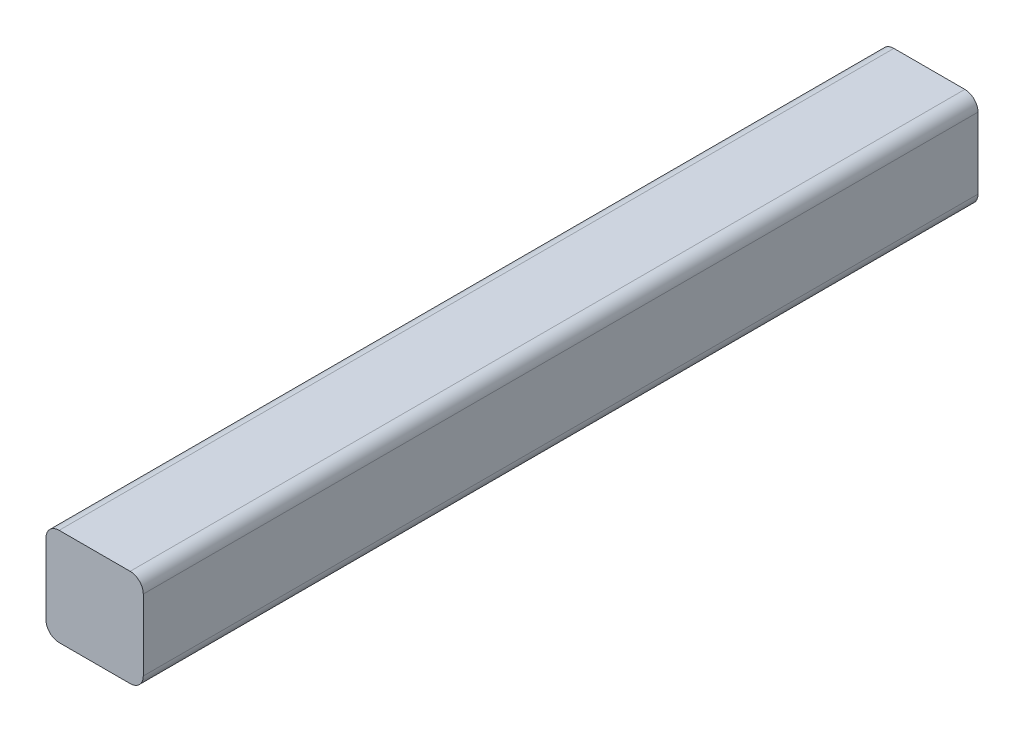
ISO-10303-21;
HEADER;
FILE_DESCRIPTION(('STEP AP214'),'2;1');
FILE_NAME('part.step','',(''),(''),'','','');
FILE_SCHEMA(('AUTOMOTIVE_DESIGN { 1 0 10303 214 1 1 1 1 }'));
ENDSEC;
DATA;
#1=APPLICATION_CONTEXT('core data for automotive mechanical design processes');
#2=APPLICATION_PROTOCOL_DEFINITION('international standard','automotive_design',2000,#1);
#3=PRODUCT_CONTEXT('',#1,'mechanical');
#4=PRODUCT('Part','Part','',(#3));
#5=PRODUCT_RELATED_PRODUCT_CATEGORY('part','',(#4));
#6=PRODUCT_DEFINITION_FORMATION('','',#4);
#7=PRODUCT_DEFINITION_CONTEXT('part definition',#1,'design');
#8=PRODUCT_DEFINITION('design','',#6,#7);
#9=PRODUCT_DEFINITION_SHAPE('','',#8);
#10=(LENGTH_UNIT() NAMED_UNIT(*) SI_UNIT(.MILLI.,.METRE.));
#11=(NAMED_UNIT(*) PLANE_ANGLE_UNIT() SI_UNIT($,.RADIAN.));
#12=(NAMED_UNIT(*) SI_UNIT($,.STERADIAN.) SOLID_ANGLE_UNIT());
#13=UNCERTAINTY_MEASURE_WITH_UNIT(LENGTH_MEASURE(1.E-05),#10,'distance_accuracy_value','');
#14=(GEOMETRIC_REPRESENTATION_CONTEXT(3) GLOBAL_UNCERTAINTY_ASSIGNED_CONTEXT((#13)) GLOBAL_UNIT_ASSIGNED_CONTEXT((#10,
#11,#12)) REPRESENTATION_CONTEXT('',''));
#15=CARTESIAN_POINT('',(0.,0.,0.));
#16=DIRECTION('',(0.,0.,1.));
#17=DIRECTION('',(1.,0.,0.));
#18=AXIS2_PLACEMENT_3D('',#15,#16,#17);
#19=CARTESIAN_POINT('',(-7.4,-7.4,127.));
#20=DIRECTION('',(1.,0.,0.));
#21=DIRECTION('',(0.,0.,-1.));
#22=AXIS2_PLACEMENT_3D('',#19,#20,#21);
#23=PLANE('',#22);
#24=DIRECTION('',(0.,-1.,0.));
#25=VECTOR('',#24,1.);
#26=CARTESIAN_POINT('',(-7.4,-7.4,0.));
#27=LINE('',#26,#25);
#28=CARTESIAN_POINT('',(-7.4,5.4,0.));
#29=VERTEX_POINT('',#28);
#30=CARTESIAN_POINT('',(-7.4,-5.4,0.));
#31=VERTEX_POINT('',#30);
#32=EDGE_CURVE('E125',#29,#31,#27,.T.);
#33=ORIENTED_EDGE('',*,*,#32,.T.);
#34=DIRECTION('',(0.,0.,-1.));
#35=VECTOR('',#34,1.);
#36=CARTESIAN_POINT('',(-7.4,-5.4,127.));
#37=LINE('',#36,#35);
#38=CARTESIAN_POINT('',(-7.4,-5.4,127.));
#39=VERTEX_POINT('',#38);
#40=EDGE_CURVE('E103',#31,#39,#37,.F.);
#41=ORIENTED_EDGE('',*,*,#40,.T.);
#42=DIRECTION('',(0.,-1.,0.));
#43=VECTOR('',#42,1.);
#44=CARTESIAN_POINT('',(-7.4,-7.4,127.));
#45=LINE('',#44,#43);
#46=CARTESIAN_POINT('',(-7.4,5.4,127.));
#47=VERTEX_POINT('',#46);
#48=EDGE_CURVE('E134',#47,#39,#45,.T.);
#49=ORIENTED_EDGE('',*,*,#48,.F.);
#50=DIRECTION('',(0.,0.,-1.));
#51=VECTOR('',#50,1.);
#52=CARTESIAN_POINT('',(-7.4,5.4,127.));
#53=LINE('',#52,#51);
#54=EDGE_CURVE('E108',#47,#29,#53,.T.);
#55=ORIENTED_EDGE('',*,*,#54,.T.);
#56=EDGE_LOOP('',(#33,#41,#49,#55));
#57=FACE_BOUND('',#56,.T.);
#58=ADVANCED_FACE('F33',(#57),#23,.F.);
#59=CARTESIAN_POINT('',(7.4,-7.4,127.));
#60=DIRECTION('',(0.,1.,0.));
#61=DIRECTION('',(-1.,0.,0.));
#62=AXIS2_PLACEMENT_3D('',#59,#60,#61);
#63=PLANE('',#62);
#64=DIRECTION('',(1.,0.,0.));
#65=VECTOR('',#64,1.);
#66=CARTESIAN_POINT('',(7.4,-7.4,127.));
#67=LINE('',#66,#65);
#68=CARTESIAN_POINT('',(-5.4,-7.4,127.));
#69=VERTEX_POINT('',#68);
#70=CARTESIAN_POINT('',(5.4,-7.4,127.));
#71=VERTEX_POINT('',#70);
#72=EDGE_CURVE('E118',#69,#71,#67,.T.);
#73=ORIENTED_EDGE('',*,*,#72,.F.);
#74=DIRECTION('',(0.,0.,-1.));
#75=VECTOR('',#74,1.);
#76=CARTESIAN_POINT('',(-5.4,-7.4,127.));
#77=LINE('',#76,#75);
#78=CARTESIAN_POINT('',(-5.4,-7.4,0.));
#79=VERTEX_POINT('',#78);
#80=EDGE_CURVE('E102',#69,#79,#77,.T.);
#81=ORIENTED_EDGE('',*,*,#80,.T.);
#82=DIRECTION('',(1.,0.,0.));
#83=VECTOR('',#82,1.);
#84=CARTESIAN_POINT('',(7.4,-7.4,0.));
#85=LINE('',#84,#83);
#86=CARTESIAN_POINT('',(5.4,-7.4,0.));
#87=VERTEX_POINT('',#86);
#88=EDGE_CURVE('E115',#79,#87,#85,.T.);
#89=ORIENTED_EDGE('',*,*,#88,.T.);
#90=DIRECTION('',(0.,0.,-1.));
#91=VECTOR('',#90,1.);
#92=CARTESIAN_POINT('',(5.4,-7.4,127.));
#93=LINE('',#92,#91);
#94=EDGE_CURVE('E120',#87,#71,#93,.F.);
#95=ORIENTED_EDGE('',*,*,#94,.T.);
#96=EDGE_LOOP('',(#73,#81,#89,#95));
#97=FACE_BOUND('',#96,.T.);
#98=ADVANCED_FACE('F114',(#97),#63,.F.);
#99=CARTESIAN_POINT('',(7.4,-7.4,127.));
#100=DIRECTION('',(-1.,0.,0.));
#101=DIRECTION('',(0.,0.,1.));
#102=AXIS2_PLACEMENT_3D('',#99,#100,#101);
#103=PLANE('',#102);
#104=DIRECTION('',(0.,1.,0.));
#105=VECTOR('',#104,1.);
#106=CARTESIAN_POINT('',(7.4,-7.4,127.));
#107=LINE('',#106,#105);
#108=CARTESIAN_POINT('',(7.4,-5.4,127.));
#109=VERTEX_POINT('',#108);
#110=CARTESIAN_POINT('',(7.4,5.4,127.));
#111=VERTEX_POINT('',#110);
#112=EDGE_CURVE('E168',#109,#111,#107,.T.);
#113=ORIENTED_EDGE('',*,*,#112,.F.);
#114=DIRECTION('',(0.,0.,-1.));
#115=VECTOR('',#114,1.);
#116=CARTESIAN_POINT('',(7.4,-5.4,127.));
#117=LINE('',#116,#115);
#118=CARTESIAN_POINT('',(7.4,-5.4,0.));
#119=VERTEX_POINT('',#118);
#120=EDGE_CURVE('E153',#109,#119,#117,.T.);
#121=ORIENTED_EDGE('',*,*,#120,.T.);
#122=DIRECTION('',(0.,1.,0.));
#123=VECTOR('',#122,1.);
#124=CARTESIAN_POINT('',(7.4,-7.4,0.));
#125=LINE('',#124,#123);
#126=CARTESIAN_POINT('',(7.4,5.4,0.));
#127=VERTEX_POINT('',#126);
#128=EDGE_CURVE('E124',#119,#127,#125,.T.);
#129=ORIENTED_EDGE('',*,*,#128,.T.);
#130=DIRECTION('',(0.,0.,-1.));
#131=VECTOR('',#130,1.);
#132=CARTESIAN_POINT('',(7.4,5.4,127.));
#133=LINE('',#132,#131);
#134=EDGE_CURVE('E151',#127,#111,#133,.F.);
#135=ORIENTED_EDGE('',*,*,#134,.T.);
#136=EDGE_LOOP('',(#113,#121,#129,#135));
#137=FACE_BOUND('',#136,.T.);
#138=ADVANCED_FACE('F179',(#137),#103,.F.);
#139=CARTESIAN_POINT('',(7.4,7.4,127.));
#140=DIRECTION('',(0.,-1.,0.));
#141=DIRECTION('',(1.,0.,0.));
#142=AXIS2_PLACEMENT_3D('',#139,#140,#141);
#143=PLANE('',#142);
#144=DIRECTION('',(-1.,0.,0.));
#145=VECTOR('',#144,1.);
#146=CARTESIAN_POINT('',(7.4,7.4,0.));
#147=LINE('',#146,#145);
#148=CARTESIAN_POINT('',(5.4,7.4,0.));
#149=VERTEX_POINT('',#148);
#150=CARTESIAN_POINT('',(-5.4,7.4,0.));
#151=VERTEX_POINT('',#150);
#152=EDGE_CURVE('E128',#149,#151,#147,.T.);
#153=ORIENTED_EDGE('',*,*,#152,.T.);
#154=DIRECTION('',(0.,0.,-1.));
#155=VECTOR('',#154,1.);
#156=CARTESIAN_POINT('',(-5.4,7.4,127.));
#157=LINE('',#156,#155);
#158=CARTESIAN_POINT('',(-5.4,7.4,127.));
#159=VERTEX_POINT('',#158);
#160=EDGE_CURVE('E11',#151,#159,#157,.F.);
#161=ORIENTED_EDGE('',*,*,#160,.T.);
#162=DIRECTION('',(-1.,0.,0.));
#163=VECTOR('',#162,1.);
#164=CARTESIAN_POINT('',(7.4,7.4,127.));
#165=LINE('',#164,#163);
#166=CARTESIAN_POINT('',(5.4,7.4,127.));
#167=VERTEX_POINT('',#166);
#168=EDGE_CURVE('E135',#167,#159,#165,.T.);
#169=ORIENTED_EDGE('',*,*,#168,.F.);
#170=DIRECTION('',(0.,0.,-1.));
#171=VECTOR('',#170,1.);
#172=CARTESIAN_POINT('',(5.4,7.4,127.));
#173=LINE('',#172,#171);
#174=EDGE_CURVE('E41',#167,#149,#173,.T.);
#175=ORIENTED_EDGE('',*,*,#174,.T.);
#176=EDGE_LOOP('',(#153,#161,#169,#175));
#177=FACE_BOUND('',#176,.T.);
#178=ADVANCED_FACE('F158',(#177),#143,.F.);
#179=CARTESIAN_POINT('',(0.,0.,127.));
#180=DIRECTION('',(0.,0.,1.));
#181=DIRECTION('',(1.,0.,0.));
#182=AXIS2_PLACEMENT_3D('',#179,#180,#181);
#183=PLANE('',#182);
#184=ORIENTED_EDGE('',*,*,#48,.T.);
#185=CARTESIAN_POINT('',(-5.4,-5.4,127.));
#186=DIRECTION('',(0.,0.,1.));
#187=DIRECTION('',(1.,0.,0.));
#188=AXIS2_PLACEMENT_3D('',#185,#186,#187);
#189=CIRCLE('',#188,2.);
#190=EDGE_CURVE('E149',#39,#69,#189,.T.);
#191=ORIENTED_EDGE('',*,*,#190,.T.);
#192=ORIENTED_EDGE('',*,*,#72,.T.);
#193=CARTESIAN_POINT('',(5.4,-5.4,127.));
#194=DIRECTION('',(0.,0.,1.));
#195=DIRECTION('',(1.,0.,0.));
#196=AXIS2_PLACEMENT_3D('',#193,#194,#195);
#197=CIRCLE('',#196,2.);
#198=EDGE_CURVE('E147',#71,#109,#197,.T.);
#199=ORIENTED_EDGE('',*,*,#198,.T.);
#200=ORIENTED_EDGE('',*,*,#112,.T.);
#201=CARTESIAN_POINT('',(5.4,5.4,127.));
#202=DIRECTION('',(0.,0.,1.));
#203=DIRECTION('',(1.,0.,0.));
#204=AXIS2_PLACEMENT_3D('',#201,#202,#203);
#205=CIRCLE('',#204,2.);
#206=EDGE_CURVE('E53',#111,#167,#205,.T.);
#207=ORIENTED_EDGE('',*,*,#206,.T.);
#208=ORIENTED_EDGE('',*,*,#168,.T.);
#209=CARTESIAN_POINT('',(-5.4,5.4,127.));
#210=DIRECTION('',(0.,0.,1.));
#211=DIRECTION('',(1.,0.,0.));
#212=AXIS2_PLACEMENT_3D('',#209,#210,#211);
#213=CIRCLE('',#212,2.);
#214=EDGE_CURVE('E145',#159,#47,#213,.T.);
#215=ORIENTED_EDGE('',*,*,#214,.T.);
#216=EDGE_LOOP('',(#184,#191,#192,#199,#200,#207,#208,#215));
#217=FACE_BOUND('',#216,.T.);
#218=ADVANCED_FACE('F171',(#217),#183,.T.);
#219=CARTESIAN_POINT('',(0.,0.,0.));
#220=DIRECTION('',(0.,0.,1.));
#221=DIRECTION('',(1.,0.,0.));
#222=AXIS2_PLACEMENT_3D('',#219,#220,#221);
#223=PLANE('',#222);
#224=ORIENTED_EDGE('',*,*,#88,.F.);
#225=CARTESIAN_POINT('',(-5.4,-5.4,0.));
#226=DIRECTION('',(0.,0.,1.));
#227=DIRECTION('',(1.,0.,0.));
#228=AXIS2_PLACEMENT_3D('',#225,#226,#227);
#229=CIRCLE('',#228,2.);
#230=EDGE_CURVE('E98',#79,#31,#229,.F.);
#231=ORIENTED_EDGE('',*,*,#230,.T.);
#232=ORIENTED_EDGE('',*,*,#32,.F.);
#233=CARTESIAN_POINT('',(-5.4,5.4,0.));
#234=DIRECTION('',(0.,0.,1.));
#235=DIRECTION('',(1.,0.,0.));
#236=AXIS2_PLACEMENT_3D('',#233,#234,#235);
#237=CIRCLE('',#236,2.);
#238=EDGE_CURVE('E138',#29,#151,#237,.F.);
#239=ORIENTED_EDGE('',*,*,#238,.T.);
#240=ORIENTED_EDGE('',*,*,#152,.F.);
#241=CARTESIAN_POINT('',(5.4,5.4,0.));
#242=DIRECTION('',(0.,0.,1.));
#243=DIRECTION('',(1.,0.,0.));
#244=AXIS2_PLACEMENT_3D('',#241,#242,#243);
#245=CIRCLE('',#244,2.);
#246=EDGE_CURVE('E119',#149,#127,#245,.F.);
#247=ORIENTED_EDGE('',*,*,#246,.T.);
#248=ORIENTED_EDGE('',*,*,#128,.F.);
#249=CARTESIAN_POINT('',(5.4,-5.4,0.));
#250=DIRECTION('',(0.,0.,1.));
#251=DIRECTION('',(1.,0.,0.));
#252=AXIS2_PLACEMENT_3D('',#249,#250,#251);
#253=CIRCLE('',#252,2.);
#254=EDGE_CURVE('E109',#119,#87,#253,.F.);
#255=ORIENTED_EDGE('',*,*,#254,.T.);
#256=EDGE_LOOP('',(#224,#231,#232,#239,#240,#247,#248,#255));
#257=FACE_BOUND('',#256,.T.);
#258=ADVANCED_FACE('F122',(#257),#223,.F.);
#259=CARTESIAN_POINT('',(-5.4,-5.4,127.));
#260=DIRECTION('',(0.,0.,-1.));
#261=DIRECTION('',(-1.,0.,0.));
#262=AXIS2_PLACEMENT_3D('',#259,#260,#261);
#263=CYLINDRICAL_SURFACE('',#262,2.);
#264=ORIENTED_EDGE('',*,*,#190,.F.);
#265=ORIENTED_EDGE('',*,*,#40,.F.);
#266=ORIENTED_EDGE('',*,*,#230,.F.);
#267=ORIENTED_EDGE('',*,*,#80,.F.);
#268=EDGE_LOOP('',(#264,#265,#266,#267));
#269=FACE_BOUND('',#268,.T.);
#270=ADVANCED_FACE('F101',(#269),#263,.T.);
#271=CARTESIAN_POINT('',(5.4,-5.4,127.));
#272=DIRECTION('',(0.,0.,-1.));
#273=DIRECTION('',(-1.,0.,0.));
#274=AXIS2_PLACEMENT_3D('',#271,#272,#273);
#275=CYLINDRICAL_SURFACE('',#274,2.);
#276=ORIENTED_EDGE('',*,*,#198,.F.);
#277=ORIENTED_EDGE('',*,*,#94,.F.);
#278=ORIENTED_EDGE('',*,*,#254,.F.);
#279=ORIENTED_EDGE('',*,*,#120,.F.);
#280=EDGE_LOOP('',(#276,#277,#278,#279));
#281=FACE_BOUND('',#280,.T.);
#282=ADVANCED_FACE('F191',(#281),#275,.T.);
#283=CARTESIAN_POINT('',(-5.4,5.4,127.));
#284=DIRECTION('',(0.,0.,-1.));
#285=DIRECTION('',(-1.,0.,0.));
#286=AXIS2_PLACEMENT_3D('',#283,#284,#285);
#287=CYLINDRICAL_SURFACE('',#286,2.);
#288=ORIENTED_EDGE('',*,*,#214,.F.);
#289=ORIENTED_EDGE('',*,*,#160,.F.);
#290=ORIENTED_EDGE('',*,*,#238,.F.);
#291=ORIENTED_EDGE('',*,*,#54,.F.);
#292=EDGE_LOOP('',(#288,#289,#290,#291));
#293=FACE_BOUND('',#292,.T.);
#294=ADVANCED_FACE('F163',(#293),#287,.T.);
#295=CARTESIAN_POINT('',(5.4,5.4,127.));
#296=DIRECTION('',(0.,0.,-1.));
#297=DIRECTION('',(-1.,0.,0.));
#298=AXIS2_PLACEMENT_3D('',#295,#296,#297);
#299=CYLINDRICAL_SURFACE('',#298,2.);
#300=ORIENTED_EDGE('',*,*,#206,.F.);
#301=ORIENTED_EDGE('',*,*,#134,.F.);
#302=ORIENTED_EDGE('',*,*,#246,.F.);
#303=ORIENTED_EDGE('',*,*,#174,.F.);
#304=EDGE_LOOP('',(#300,#301,#302,#303));
#305=FACE_BOUND('',#304,.T.);
#306=ADVANCED_FACE('F35',(#305),#299,.T.);
#307=CLOSED_SHELL('',(#58,#98,#138,#178,#218,#258,#270,#282,#294,#306));
#308=MANIFOLD_SOLID_BREP('B2',#307);
#309=ADVANCED_BREP_SHAPE_REPRESENTATION('',(#18,#308),#14);
#310=SHAPE_DEFINITION_REPRESENTATION(#9,#309);
ENDSEC;
END-ISO-10303-21;
